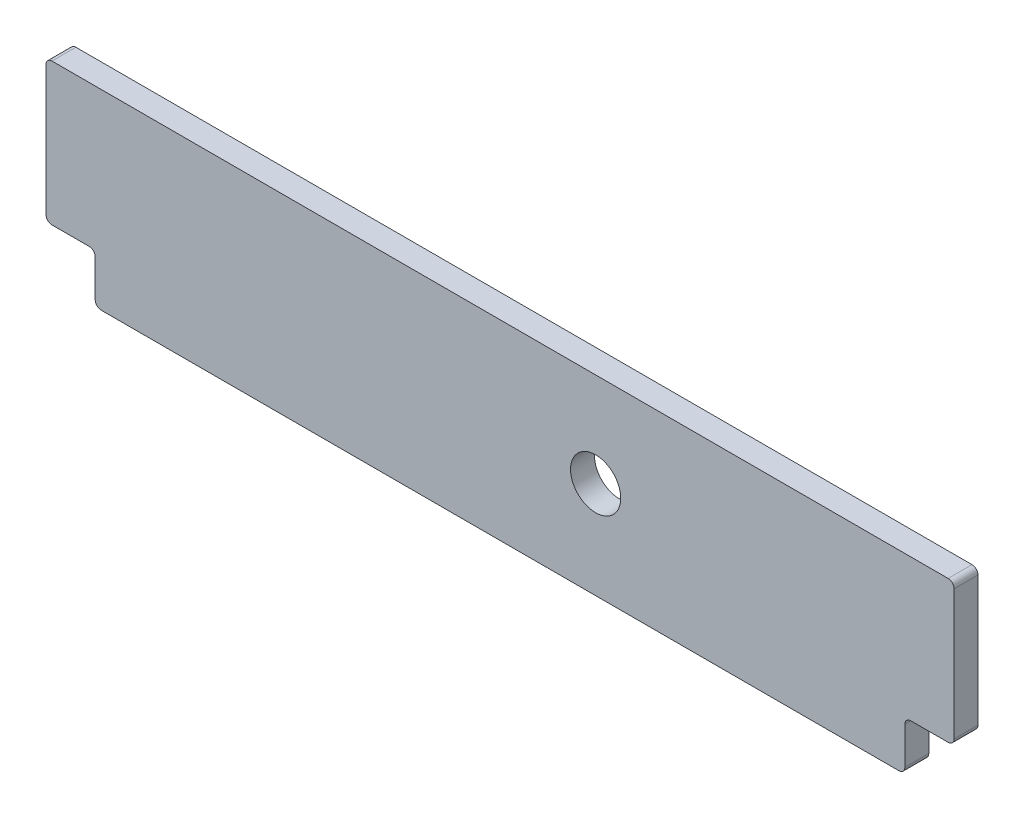
ISO-10303-21;
HEADER;
FILE_DESCRIPTION(('STEP AP214'),'2;1');
FILE_NAME('part.step','',(''),(''),'','','');
FILE_SCHEMA(('AUTOMOTIVE_DESIGN { 1 0 10303 214 1 1 1 1 }'));
ENDSEC;
DATA;
#1=APPLICATION_CONTEXT('core data for automotive mechanical design processes');
#2=APPLICATION_PROTOCOL_DEFINITION('international standard','automotive_design',2000,#1);
#3=PRODUCT_CONTEXT('',#1,'mechanical');
#4=PRODUCT('Part','Part','',(#3));
#5=PRODUCT_RELATED_PRODUCT_CATEGORY('part','',(#4));
#6=PRODUCT_DEFINITION_FORMATION('','',#4);
#7=PRODUCT_DEFINITION_CONTEXT('part definition',#1,'design');
#8=PRODUCT_DEFINITION('design','',#6,#7);
#9=PRODUCT_DEFINITION_SHAPE('','',#8);
#10=(LENGTH_UNIT() NAMED_UNIT(*) SI_UNIT(.MILLI.,.METRE.));
#11=(NAMED_UNIT(*) PLANE_ANGLE_UNIT() SI_UNIT($,.RADIAN.));
#12=(NAMED_UNIT(*) SI_UNIT($,.STERADIAN.) SOLID_ANGLE_UNIT());
#13=UNCERTAINTY_MEASURE_WITH_UNIT(LENGTH_MEASURE(1.E-05),#10,'distance_accuracy_value','');
#14=(GEOMETRIC_REPRESENTATION_CONTEXT(3) GLOBAL_UNCERTAINTY_ASSIGNED_CONTEXT((#13)) GLOBAL_UNIT_ASSIGNED_CONTEXT((#10,
#11,#12)) REPRESENTATION_CONTEXT('',''));
#15=CARTESIAN_POINT('',(0.,0.,0.));
#16=DIRECTION('',(0.,0.,1.));
#17=DIRECTION('',(1.,0.,0.));
#18=AXIS2_PLACEMENT_3D('',#15,#16,#17);
#19=CARTESIAN_POINT('',(215.138,0.,6.35));
#20=DIRECTION('',(-1.,0.,0.));
#21=DIRECTION('',(0.,-1.,0.));
#22=AXIS2_PLACEMENT_3D('',#19,#20,#21);
#23=PLANE('',#22);
#24=DIRECTION('',(0.,1.,0.));
#25=VECTOR('',#24,1.);
#26=CARTESIAN_POINT('',(215.138,2.35089725464378E-13,6.35));
#27=LINE('',#26,#25);
#28=CARTESIAN_POINT('',(215.138,3.17500000000005,6.35));
#29=VERTEX_POINT('',#28);
#30=CARTESIAN_POINT('',(215.138,22.9869999999999,6.35));
#31=VERTEX_POINT('',#30);
#32=EDGE_CURVE('E236',#29,#31,#27,.T.);
#33=ORIENTED_EDGE('',*,*,#32,.F.);
#34=DIRECTION('',(0.,0.,-1.));
#35=VECTOR('',#34,1.);
#36=CARTESIAN_POINT('',(215.138,3.17500000000005,6.35));
#37=LINE('',#36,#35);
#38=CARTESIAN_POINT('',(215.138,3.17500000000005,-6.35));
#39=VERTEX_POINT('',#38);
#40=EDGE_CURVE('E293',#29,#39,#37,.T.);
#41=ORIENTED_EDGE('',*,*,#40,.T.);
#42=DIRECTION('',(0.,1.,0.));
#43=VECTOR('',#42,1.);
#44=CARTESIAN_POINT('',(215.138,2.35089725464378E-13,-6.35));
#45=LINE('',#44,#43);
#46=CARTESIAN_POINT('',(215.138,22.9869999999999,-6.35));
#47=VERTEX_POINT('',#46);
#48=EDGE_CURVE('E232',#39,#47,#45,.T.);
#49=ORIENTED_EDGE('',*,*,#48,.T.);
#50=DIRECTION('',(0.,0.,-1.));
#51=VECTOR('',#50,1.);
#52=CARTESIAN_POINT('',(215.138,22.9869999999999,6.35));
#53=LINE('',#52,#51);
#54=EDGE_CURVE('E290',#47,#31,#53,.F.);
#55=ORIENTED_EDGE('',*,*,#54,.T.);
#56=EDGE_LOOP('',(#33,#41,#49,#55));
#57=FACE_BOUND('',#56,.T.);
#58=ADVANCED_FACE('F44',(#57),#23,.F.);
#59=CARTESIAN_POINT('',(215.9,26.1619999999999,6.35));
#60=DIRECTION('',(0.,1.,0.));
#61=DIRECTION('',(-1.,0.,0.));
#62=AXIS2_PLACEMENT_3D('',#59,#60,#61);
#63=PLANE('',#62);
#64=DIRECTION('',(1.,0.,0.));
#65=VECTOR('',#64,1.);
#66=CARTESIAN_POINT('',(0.,26.162,6.35));
#67=LINE('',#66,#65);
#68=CARTESIAN_POINT('',(218.313,26.1619999999999,6.35));
#69=VERTEX_POINT('',#68);
#70=CARTESIAN_POINT('',(238.125,26.1619999999999,6.35));
#71=VERTEX_POINT('',#70);
#72=EDGE_CURVE('E218',#69,#71,#67,.T.);
#73=ORIENTED_EDGE('',*,*,#72,.F.);
#74=DIRECTION('',(0.,0.,-1.));
#75=VECTOR('',#74,1.);
#76=CARTESIAN_POINT('',(218.313,26.1619999999999,-6.35));
#77=LINE('',#76,#75);
#78=CARTESIAN_POINT('',(218.313,26.1619999999999,-6.35));
#79=VERTEX_POINT('',#78);
#80=EDGE_CURVE('E306',#69,#79,#77,.T.);
#81=ORIENTED_EDGE('',*,*,#80,.T.);
#82=DIRECTION('',(1.,0.,0.));
#83=VECTOR('',#82,1.);
#84=CARTESIAN_POINT('',(0.,26.162,-6.35));
#85=LINE('',#84,#83);
#86=CARTESIAN_POINT('',(238.125,26.1619999999999,-6.35));
#87=VERTEX_POINT('',#86);
#88=EDGE_CURVE('E198',#79,#87,#85,.T.);
#89=ORIENTED_EDGE('',*,*,#88,.T.);
#90=DIRECTION('',(0.,0.,-1.));
#91=VECTOR('',#90,1.);
#92=CARTESIAN_POINT('',(238.125,26.1619999999999,6.35));
#93=LINE('',#92,#91);
#94=EDGE_CURVE('E303',#87,#71,#93,.F.);
#95=ORIENTED_EDGE('',*,*,#94,.T.);
#96=EDGE_LOOP('',(#73,#81,#89,#95));
#97=FACE_BOUND('',#96,.T.);
#98=ADVANCED_FACE('F355',(#97),#63,.F.);
#99=CARTESIAN_POINT('',(241.3,101.6,6.35));
#100=DIRECTION('',(-1.,0.,0.));
#101=DIRECTION('',(0.,-1.,0.));
#102=AXIS2_PLACEMENT_3D('',#99,#100,#101);
#103=PLANE('',#102);
#104=DIRECTION('',(0.,1.,0.));
#105=VECTOR('',#104,1.);
#106=CARTESIAN_POINT('',(241.3,101.6,-6.35));
#107=LINE('',#106,#105);
#108=CARTESIAN_POINT('',(241.3,29.3369999999999,-6.35));
#109=VERTEX_POINT('',#108);
#110=CARTESIAN_POINT('',(241.3,98.4249999999999,-6.35));
#111=VERTEX_POINT('',#110);
#112=EDGE_CURVE('E191',#109,#111,#107,.T.);
#113=ORIENTED_EDGE('',*,*,#112,.T.);
#114=DIRECTION('',(0.,0.,-1.));
#115=VECTOR('',#114,1.);
#116=CARTESIAN_POINT('',(241.3,98.4249999999999,6.35));
#117=LINE('',#116,#115);
#118=CARTESIAN_POINT('',(241.3,98.4249999999999,6.35));
#119=VERTEX_POINT('',#118);
#120=EDGE_CURVE('E166',#111,#119,#117,.F.);
#121=ORIENTED_EDGE('',*,*,#120,.T.);
#122=DIRECTION('',(0.,1.,0.));
#123=VECTOR('',#122,1.);
#124=CARTESIAN_POINT('',(241.3,101.6,6.35));
#125=LINE('',#124,#123);
#126=CARTESIAN_POINT('',(241.3,29.3369999999999,6.35));
#127=VERTEX_POINT('',#126);
#128=EDGE_CURVE('E214',#127,#119,#125,.T.);
#129=ORIENTED_EDGE('',*,*,#128,.F.);
#130=DIRECTION('',(0.,0.,-1.));
#131=VECTOR('',#130,1.);
#132=CARTESIAN_POINT('',(241.3,29.3369999999999,6.35));
#133=LINE('',#132,#131);
#134=EDGE_CURVE('E172',#127,#109,#133,.T.);
#135=ORIENTED_EDGE('',*,*,#134,.T.);
#136=EDGE_LOOP('',(#113,#121,#129,#135));
#137=FACE_BOUND('',#136,.T.);
#138=ADVANCED_FACE('F348',(#137),#103,.F.);
#139=CARTESIAN_POINT('',(-241.3,101.6,6.35));
#140=DIRECTION('',(0.,-1.,0.));
#141=DIRECTION('',(1.,0.,0.));
#142=AXIS2_PLACEMENT_3D('',#139,#140,#141);
#143=PLANE('',#142);
#144=DIRECTION('',(-1.,0.,0.));
#145=VECTOR('',#144,1.);
#146=CARTESIAN_POINT('',(-241.3,101.6,6.35));
#147=LINE('',#146,#145);
#148=CARTESIAN_POINT('',(238.125,101.6,6.35));
#149=VERTEX_POINT('',#148);
#150=CARTESIAN_POINT('',(-238.125,101.6,6.35));
#151=VERTEX_POINT('',#150);
#152=EDGE_CURVE('E182',#149,#151,#147,.T.);
#153=ORIENTED_EDGE('',*,*,#152,.F.);
#154=DIRECTION('',(0.,0.,-1.));
#155=VECTOR('',#154,1.);
#156=CARTESIAN_POINT('',(238.125,101.6,6.35));
#157=LINE('',#156,#155);
#158=CARTESIAN_POINT('',(238.125,101.6,-6.35));
#159=VERTEX_POINT('',#158);
#160=EDGE_CURVE('E165',#149,#159,#157,.T.);
#161=ORIENTED_EDGE('',*,*,#160,.T.);
#162=DIRECTION('',(-1.,0.,0.));
#163=VECTOR('',#162,1.);
#164=CARTESIAN_POINT('',(-241.3,101.6,-6.35));
#165=LINE('',#164,#163);
#166=CARTESIAN_POINT('',(-238.125,101.6,-6.35));
#167=VERTEX_POINT('',#166);
#168=EDGE_CURVE('E179',#159,#167,#165,.T.);
#169=ORIENTED_EDGE('',*,*,#168,.T.);
#170=DIRECTION('',(0.,0.,-1.));
#171=VECTOR('',#170,1.);
#172=CARTESIAN_POINT('',(-238.125,101.6,6.35));
#173=LINE('',#172,#171);
#174=EDGE_CURVE('E185',#167,#151,#173,.F.);
#175=ORIENTED_EDGE('',*,*,#174,.T.);
#176=EDGE_LOOP('',(#153,#161,#169,#175));
#177=FACE_BOUND('',#176,.T.);
#178=ADVANCED_FACE('F178',(#177),#143,.F.);
#179=CARTESIAN_POINT('',(-241.3,101.6,6.35));
#180=DIRECTION('',(1.,0.,0.));
#181=DIRECTION('',(0.,0.,-1.));
#182=AXIS2_PLACEMENT_3D('',#179,#180,#181);
#183=PLANE('',#182);
#184=DIRECTION('',(0.,-1.,0.));
#185=VECTOR('',#184,1.);
#186=CARTESIAN_POINT('',(-241.3,101.6,6.35));
#187=LINE('',#186,#185);
#188=CARTESIAN_POINT('',(-241.3,98.4250000000001,6.35));
#189=VERTEX_POINT('',#188);
#190=CARTESIAN_POINT('',(-241.3,29.3370000000001,6.35));
#191=VERTEX_POINT('',#190);
#192=EDGE_CURVE('E207',#189,#191,#187,.T.);
#193=ORIENTED_EDGE('',*,*,#192,.F.);
#194=DIRECTION('',(0.,0.,-1.));
#195=VECTOR('',#194,1.);
#196=CARTESIAN_POINT('',(-241.3,98.4250000000001,6.35));
#197=LINE('',#196,#195);
#198=CARTESIAN_POINT('',(-241.3,98.4250000000001,-6.35));
#199=VERTEX_POINT('',#198);
#200=EDGE_CURVE('E286',#189,#199,#197,.T.);
#201=ORIENTED_EDGE('',*,*,#200,.T.);
#202=DIRECTION('',(0.,-1.,0.));
#203=VECTOR('',#202,1.);
#204=CARTESIAN_POINT('',(-241.3,101.6,-6.35));
#205=LINE('',#204,#203);
#206=CARTESIAN_POINT('',(-241.3,29.3370000000001,-6.35));
#207=VERTEX_POINT('',#206);
#208=EDGE_CURVE('E190',#199,#207,#205,.T.);
#209=ORIENTED_EDGE('',*,*,#208,.T.);
#210=DIRECTION('',(0.,0.,-1.));
#211=VECTOR('',#210,1.);
#212=CARTESIAN_POINT('',(-241.3,29.337,6.35));
#213=LINE('',#212,#211);
#214=EDGE_CURVE('E283',#207,#191,#213,.F.);
#215=ORIENTED_EDGE('',*,*,#214,.T.);
#216=EDGE_LOOP('',(#193,#201,#209,#215));
#217=FACE_BOUND('',#216,.T.);
#218=ADVANCED_FACE('F394',(#217),#183,.F.);
#219=CARTESIAN_POINT('',(-215.9,26.162,6.35));
#220=DIRECTION('',(0.,1.,0.));
#221=DIRECTION('',(0.,0.,1.));
#222=AXIS2_PLACEMENT_3D('',#219,#220,#221);
#223=PLANE('',#222);
#224=DIRECTION('',(1.,0.,0.));
#225=VECTOR('',#224,1.);
#226=CARTESIAN_POINT('',(0.,26.162,6.35));
#227=LINE('',#226,#225);
#228=CARTESIAN_POINT('',(-238.125,26.162,6.35));
#229=VERTEX_POINT('',#228);
#230=CARTESIAN_POINT('',(-218.313,26.162,6.35));
#231=VERTEX_POINT('',#230);
#232=EDGE_CURVE('E211',#229,#231,#227,.T.);
#233=ORIENTED_EDGE('',*,*,#232,.F.);
#234=DIRECTION('',(0.,0.,-1.));
#235=VECTOR('',#234,1.);
#236=CARTESIAN_POINT('',(-238.125,26.162,6.35));
#237=LINE('',#236,#235);
#238=CARTESIAN_POINT('',(-238.125,26.162,-6.35));
#239=VERTEX_POINT('',#238);
#240=EDGE_CURVE('E313',#229,#239,#237,.T.);
#241=ORIENTED_EDGE('',*,*,#240,.T.);
#242=DIRECTION('',(1.,0.,0.));
#243=VECTOR('',#242,1.);
#244=CARTESIAN_POINT('',(0.,26.162,-6.35));
#245=LINE('',#244,#243);
#246=CARTESIAN_POINT('',(-218.313,26.162,-6.35));
#247=VERTEX_POINT('',#246);
#248=EDGE_CURVE('E196',#239,#247,#245,.T.);
#249=ORIENTED_EDGE('',*,*,#248,.T.);
#250=DIRECTION('',(0.,0.,-1.));
#251=VECTOR('',#250,1.);
#252=CARTESIAN_POINT('',(-218.313,26.162,6.35));
#253=LINE('',#252,#251);
#254=EDGE_CURVE('E310',#247,#231,#253,.F.);
#255=ORIENTED_EDGE('',*,*,#254,.T.);
#256=EDGE_LOOP('',(#233,#241,#249,#255));
#257=FACE_BOUND('',#256,.T.);
#258=ADVANCED_FACE('F386',(#257),#223,.F.);
#259=CARTESIAN_POINT('',(-215.138,25.4,6.35));
#260=DIRECTION('',(1.,0.,0.));
#261=DIRECTION('',(0.,0.,-1.));
#262=AXIS2_PLACEMENT_3D('',#259,#260,#261);
#263=PLANE('',#262);
#264=DIRECTION('',(0.,-1.,0.));
#265=VECTOR('',#264,1.);
#266=CARTESIAN_POINT('',(-215.138,0.,-6.35));
#267=LINE('',#266,#265);
#268=CARTESIAN_POINT('',(-215.138,22.987,-6.35));
#269=VERTEX_POINT('',#268);
#270=CARTESIAN_POINT('',(-215.138,3.17500000000004,-6.35));
#271=VERTEX_POINT('',#270);
#272=EDGE_CURVE('E222',#269,#271,#267,.T.);
#273=ORIENTED_EDGE('',*,*,#272,.T.);
#274=DIRECTION('',(0.,0.,-1.));
#275=VECTOR('',#274,1.);
#276=CARTESIAN_POINT('',(-215.138,3.17500000000004,6.35));
#277=LINE('',#276,#275);
#278=CARTESIAN_POINT('',(-215.138,3.17500000000004,6.35));
#279=VERTEX_POINT('',#278);
#280=EDGE_CURVE('E321',#271,#279,#277,.F.);
#281=ORIENTED_EDGE('',*,*,#280,.T.);
#282=DIRECTION('',(0.,-1.,0.));
#283=VECTOR('',#282,1.);
#284=CARTESIAN_POINT('',(-215.138,0.,6.35));
#285=LINE('',#284,#283);
#286=CARTESIAN_POINT('',(-215.138,22.987,6.35));
#287=VERTEX_POINT('',#286);
#288=EDGE_CURVE('E206',#287,#279,#285,.T.);
#289=ORIENTED_EDGE('',*,*,#288,.F.);
#290=DIRECTION('',(0.,0.,-1.));
#291=VECTOR('',#290,1.);
#292=CARTESIAN_POINT('',(-215.138,22.987,-6.35));
#293=LINE('',#292,#291);
#294=EDGE_CURVE('E317',#287,#269,#293,.T.);
#295=ORIENTED_EDGE('',*,*,#294,.T.);
#296=EDGE_LOOP('',(#273,#281,#289,#295));
#297=FACE_BOUND('',#296,.T.);
#298=ADVANCED_FACE('F376',(#297),#263,.F.);
#299=CARTESIAN_POINT('',(-215.9,0.,6.35));
#300=DIRECTION('',(0.,1.,0.));
#301=DIRECTION('',(0.,0.,1.));
#302=AXIS2_PLACEMENT_3D('',#299,#300,#301);
#303=PLANE('',#302);
#304=DIRECTION('',(1.,0.,0.));
#305=VECTOR('',#304,1.);
#306=CARTESIAN_POINT('',(-215.9,0.,-6.35));
#307=LINE('',#306,#305);
#308=CARTESIAN_POINT('',(-211.963,0.,-6.35));
#309=VERTEX_POINT('',#308);
#310=CARTESIAN_POINT('',(211.963,0.,-6.35));
#311=VERTEX_POINT('',#310);
#312=EDGE_CURVE('E231',#309,#311,#307,.T.);
#313=ORIENTED_EDGE('',*,*,#312,.T.);
#314=DIRECTION('',(0.,0.,-1.));
#315=VECTOR('',#314,1.);
#316=CARTESIAN_POINT('',(211.963,0.,6.35));
#317=LINE('',#316,#315);
#318=CARTESIAN_POINT('',(211.963,0.,6.35));
#319=VERTEX_POINT('',#318);
#320=EDGE_CURVE('E62',#311,#319,#317,.F.);
#321=ORIENTED_EDGE('',*,*,#320,.T.);
#322=DIRECTION('',(1.,0.,0.));
#323=VECTOR('',#322,1.);
#324=CARTESIAN_POINT('',(-215.9,0.,6.35));
#325=LINE('',#324,#323);
#326=CARTESIAN_POINT('',(-211.963,0.,6.35));
#327=VERTEX_POINT('',#326);
#328=EDGE_CURVE('E202',#327,#319,#325,.T.);
#329=ORIENTED_EDGE('',*,*,#328,.F.);
#330=DIRECTION('',(0.,0.,-1.));
#331=VECTOR('',#330,1.);
#332=CARTESIAN_POINT('',(-211.963,0.,6.35));
#333=LINE('',#332,#331);
#334=EDGE_CURVE('E297',#327,#309,#333,.T.);
#335=ORIENTED_EDGE('',*,*,#334,.T.);
#336=EDGE_LOOP('',(#313,#321,#329,#335));
#337=FACE_BOUND('',#336,.T.);
#338=ADVANCED_FACE('F342',(#337),#303,.F.);
#339=CARTESIAN_POINT('',(0.,0.,6.35));
#340=DIRECTION('',(0.,0.,-1.));
#341=DIRECTION('',(-1.,0.,0.));
#342=AXIS2_PLACEMENT_3D('',#339,#340,#341);
#343=PLANE('',#342);
#344=CARTESIAN_POINT('',(50.8000000000006,51.5000000000016,6.34999999999999));
#345=DIRECTION('',(0.,0.,-1.));
#346=DIRECTION('',(-1.,0.,0.));
#347=AXIS2_PLACEMENT_3D('',#344,#345,#346);
#348=CIRCLE('',#347,13.3350000000001);
#349=CARTESIAN_POINT('',(37.4650000000005,51.5000000000016,6.34999999999999));
#350=VERTEX_POINT('',#349);
#351=EDGE_CURVE('E48',#350,#350,#348,.F.);
#352=ORIENTED_EDGE('',*,*,#351,.F.);
#353=EDGE_LOOP('',(#352));
#354=FACE_BOUND('',#353,.T.);
#355=ORIENTED_EDGE('',*,*,#128,.T.);
#356=CARTESIAN_POINT('',(238.125,98.4249999999999,6.35));
#357=DIRECTION('',(0.,0.,-1.));
#358=DIRECTION('',(-1.,0.,0.));
#359=AXIS2_PLACEMENT_3D('',#356,#357,#358);
#360=CIRCLE('',#359,3.175);
#361=EDGE_CURVE('E280',#119,#149,#360,.F.);
#362=ORIENTED_EDGE('',*,*,#361,.T.);
#363=ORIENTED_EDGE('',*,*,#152,.T.);
#364=CARTESIAN_POINT('',(-238.125,98.4250000000001,6.35));
#365=DIRECTION('',(0.,0.,-1.));
#366=DIRECTION('',(-1.,0.,0.));
#367=AXIS2_PLACEMENT_3D('',#364,#365,#366);
#368=CIRCLE('',#367,3.175);
#369=EDGE_CURVE('E277',#151,#189,#368,.F.);
#370=ORIENTED_EDGE('',*,*,#369,.T.);
#371=ORIENTED_EDGE('',*,*,#192,.T.);
#372=CARTESIAN_POINT('',(-238.125,29.337,6.35));
#373=DIRECTION('',(0.,0.,-1.));
#374=DIRECTION('',(-1.,0.,0.));
#375=AXIS2_PLACEMENT_3D('',#372,#373,#374);
#376=CIRCLE('',#375,3.175);
#377=EDGE_CURVE('E268',#191,#229,#376,.F.);
#378=ORIENTED_EDGE('',*,*,#377,.T.);
#379=ORIENTED_EDGE('',*,*,#232,.T.);
#380=CARTESIAN_POINT('',(-218.313,22.987,6.35));
#381=DIRECTION('',(0.,0.,-1.));
#382=DIRECTION('',(-1.,0.,0.));
#383=AXIS2_PLACEMENT_3D('',#380,#381,#382);
#384=CIRCLE('',#383,3.175);
#385=EDGE_CURVE('E12',#231,#287,#384,.T.);
#386=ORIENTED_EDGE('',*,*,#385,.T.);
#387=ORIENTED_EDGE('',*,*,#288,.T.);
#388=CARTESIAN_POINT('',(-211.963,3.17500000000004,6.35));
#389=DIRECTION('',(0.,0.,-1.));
#390=DIRECTION('',(-1.,0.,0.));
#391=AXIS2_PLACEMENT_3D('',#388,#389,#390);
#392=CIRCLE('',#391,3.175);
#393=EDGE_CURVE('E69',#279,#327,#392,.F.);
#394=ORIENTED_EDGE('',*,*,#393,.T.);
#395=ORIENTED_EDGE('',*,*,#328,.T.);
#396=CARTESIAN_POINT('',(211.963,3.17500000000004,6.35));
#397=DIRECTION('',(0.,0.,-1.));
#398=DIRECTION('',(-1.,0.,0.));
#399=AXIS2_PLACEMENT_3D('',#396,#397,#398);
#400=CIRCLE('',#399,3.175);
#401=EDGE_CURVE('E274',#319,#29,#400,.F.);
#402=ORIENTED_EDGE('',*,*,#401,.T.);
#403=ORIENTED_EDGE('',*,*,#32,.T.);
#404=CARTESIAN_POINT('',(218.313,22.9869999999999,6.35));
#405=DIRECTION('',(0.,0.,-1.));
#406=DIRECTION('',(-1.,0.,0.));
#407=AXIS2_PLACEMENT_3D('',#404,#405,#406);
#408=CIRCLE('',#407,3.175);
#409=EDGE_CURVE('E327',#31,#69,#408,.T.);
#410=ORIENTED_EDGE('',*,*,#409,.T.);
#411=ORIENTED_EDGE('',*,*,#72,.T.);
#412=CARTESIAN_POINT('',(238.125,29.3369999999999,6.35));
#413=DIRECTION('',(0.,0.,-1.));
#414=DIRECTION('',(-1.,0.,0.));
#415=AXIS2_PLACEMENT_3D('',#412,#413,#414);
#416=CIRCLE('',#415,3.175);
#417=EDGE_CURVE('E271',#71,#127,#416,.F.);
#418=ORIENTED_EDGE('',*,*,#417,.T.);
#419=EDGE_LOOP('',(#355,#362,#363,#370,#371,#378,#379,#386,#387,#394,#395,#402,#403,#410,#411,#418));
#420=FACE_BOUND('',#419,.T.);
#421=ADVANCED_FACE('F340',(#354,#420),#343,.F.);
#422=CARTESIAN_POINT('',(0.,0.,-6.35));
#423=DIRECTION('',(0.,0.,-1.));
#424=DIRECTION('',(-1.,0.,0.));
#425=AXIS2_PLACEMENT_3D('',#422,#423,#424);
#426=PLANE('',#425);
#427=CARTESIAN_POINT('',(50.8000000000006,51.5000000000016,-6.34999999999999));
#428=DIRECTION('',(0.,0.,-1.));
#429=DIRECTION('',(-1.,0.,0.));
#430=AXIS2_PLACEMENT_3D('',#427,#428,#429);
#431=CIRCLE('',#430,13.3350000000001);
#432=CARTESIAN_POINT('',(37.4650000000005,51.5000000000016,-6.34999999999999));
#433=VERTEX_POINT('',#432);
#434=EDGE_CURVE('E205',#433,#433,#431,.F.);
#435=ORIENTED_EDGE('',*,*,#434,.T.);
#436=EDGE_LOOP('',(#435));
#437=FACE_BOUND('',#436,.T.);
#438=ORIENTED_EDGE('',*,*,#168,.F.);
#439=CARTESIAN_POINT('',(238.125,98.4249999999999,-6.35));
#440=DIRECTION('',(0.,0.,-1.));
#441=DIRECTION('',(-1.,0.,0.));
#442=AXIS2_PLACEMENT_3D('',#439,#440,#441);
#443=CIRCLE('',#442,3.175);
#444=EDGE_CURVE('E161',#159,#111,#443,.T.);
#445=ORIENTED_EDGE('',*,*,#444,.T.);
#446=ORIENTED_EDGE('',*,*,#112,.F.);
#447=CARTESIAN_POINT('',(238.125,29.3369999999999,-6.35));
#448=DIRECTION('',(0.,0.,-1.));
#449=DIRECTION('',(-1.,0.,0.));
#450=AXIS2_PLACEMENT_3D('',#447,#448,#449);
#451=CIRCLE('',#450,3.175);
#452=EDGE_CURVE('E253',#109,#87,#451,.T.);
#453=ORIENTED_EDGE('',*,*,#452,.T.);
#454=ORIENTED_EDGE('',*,*,#88,.F.);
#455=CARTESIAN_POINT('',(218.313,22.9869999999999,-6.35));
#456=DIRECTION('',(0.,0.,-1.));
#457=DIRECTION('',(-1.,0.,0.));
#458=AXIS2_PLACEMENT_3D('',#455,#456,#457);
#459=CIRCLE('',#458,3.175);
#460=EDGE_CURVE('E324',#79,#47,#459,.F.);
#461=ORIENTED_EDGE('',*,*,#460,.T.);
#462=ORIENTED_EDGE('',*,*,#48,.F.);
#463=CARTESIAN_POINT('',(211.963,3.17500000000004,-6.35));
#464=DIRECTION('',(0.,0.,-1.));
#465=DIRECTION('',(-1.,0.,0.));
#466=AXIS2_PLACEMENT_3D('',#463,#464,#465);
#467=CIRCLE('',#466,3.175);
#468=EDGE_CURVE('E256',#39,#311,#467,.T.);
#469=ORIENTED_EDGE('',*,*,#468,.T.);
#470=ORIENTED_EDGE('',*,*,#312,.F.);
#471=CARTESIAN_POINT('',(-211.963,3.17500000000004,-6.35));
#472=DIRECTION('',(0.,0.,-1.));
#473=DIRECTION('',(-1.,0.,0.));
#474=AXIS2_PLACEMENT_3D('',#471,#472,#473);
#475=CIRCLE('',#474,3.175);
#476=EDGE_CURVE('E184',#309,#271,#475,.T.);
#477=ORIENTED_EDGE('',*,*,#476,.T.);
#478=ORIENTED_EDGE('',*,*,#272,.F.);
#479=CARTESIAN_POINT('',(-218.313,22.987,-6.35));
#480=DIRECTION('',(0.,0.,-1.));
#481=DIRECTION('',(-1.,0.,0.));
#482=AXIS2_PLACEMENT_3D('',#479,#480,#481);
#483=CIRCLE('',#482,3.175);
#484=EDGE_CURVE('E54',#269,#247,#483,.F.);
#485=ORIENTED_EDGE('',*,*,#484,.T.);
#486=ORIENTED_EDGE('',*,*,#248,.F.);
#487=CARTESIAN_POINT('',(-238.125,29.337,-6.35));
#488=DIRECTION('',(0.,0.,-1.));
#489=DIRECTION('',(-1.,0.,0.));
#490=AXIS2_PLACEMENT_3D('',#487,#488,#489);
#491=CIRCLE('',#490,3.175);
#492=EDGE_CURVE('E250',#239,#207,#491,.T.);
#493=ORIENTED_EDGE('',*,*,#492,.T.);
#494=ORIENTED_EDGE('',*,*,#208,.F.);
#495=CARTESIAN_POINT('',(-238.125,98.4250000000001,-6.35));
#496=DIRECTION('',(0.,0.,-1.));
#497=DIRECTION('',(-1.,0.,0.));
#498=AXIS2_PLACEMENT_3D('',#495,#496,#497);
#499=CIRCLE('',#498,3.175);
#500=EDGE_CURVE('E173',#199,#167,#499,.T.);
#501=ORIENTED_EDGE('',*,*,#500,.T.);
#502=EDGE_LOOP('',(#438,#445,#446,#453,#454,#461,#462,#469,#470,#477,#478,#485,#486,#493,#494,#501));
#503=FACE_BOUND('',#502,.T.);
#504=ADVANCED_FACE('F187',(#437,#503),#426,.T.);
#505=CARTESIAN_POINT('',(50.8000000000006,51.5000000000017,-101.056542434233));
#506=DIRECTION('',(0.,0.,1.));
#507=DIRECTION('',(0.,-1.,0.));
#508=AXIS2_PLACEMENT_3D('',#505,#506,#507);
#509=CYLINDRICAL_SURFACE('',#508,13.3350000000001);
#510=ORIENTED_EDGE('',*,*,#434,.F.);
#511=EDGE_LOOP('',(#510));
#512=FACE_BOUND('',#511,.T.);
#513=ORIENTED_EDGE('',*,*,#351,.T.);
#514=EDGE_LOOP('',(#513));
#515=FACE_BOUND('',#514,.T.);
#516=ADVANCED_FACE('F46',(#512,#515),#509,.F.);
#517=CARTESIAN_POINT('',(238.125,98.4249999999999,6.35));
#518=DIRECTION('',(0.,0.,-1.));
#519=DIRECTION('',(-1.,0.,0.));
#520=AXIS2_PLACEMENT_3D('',#517,#518,#519);
#521=CYLINDRICAL_SURFACE('',#520,3.175);
#522=ORIENTED_EDGE('',*,*,#361,.F.);
#523=ORIENTED_EDGE('',*,*,#120,.F.);
#524=ORIENTED_EDGE('',*,*,#444,.F.);
#525=ORIENTED_EDGE('',*,*,#160,.F.);
#526=EDGE_LOOP('',(#522,#523,#524,#525));
#527=FACE_BOUND('',#526,.T.);
#528=ADVANCED_FACE('F164',(#527),#521,.T.);
#529=CARTESIAN_POINT('',(-238.125,98.4250000000001,6.35));
#530=DIRECTION('',(0.,0.,-1.));
#531=DIRECTION('',(-1.,0.,0.));
#532=AXIS2_PLACEMENT_3D('',#529,#530,#531);
#533=CYLINDRICAL_SURFACE('',#532,3.175);
#534=ORIENTED_EDGE('',*,*,#369,.F.);
#535=ORIENTED_EDGE('',*,*,#174,.F.);
#536=ORIENTED_EDGE('',*,*,#500,.F.);
#537=ORIENTED_EDGE('',*,*,#200,.F.);
#538=EDGE_LOOP('',(#534,#535,#536,#537));
#539=FACE_BOUND('',#538,.T.);
#540=ADVANCED_FACE('F398',(#539),#533,.T.);
#541=CARTESIAN_POINT('',(211.963,3.17500000000004,6.35));
#542=DIRECTION('',(0.,0.,-1.));
#543=DIRECTION('',(-1.,0.,0.));
#544=AXIS2_PLACEMENT_3D('',#541,#542,#543);
#545=CYLINDRICAL_SURFACE('',#544,3.175);
#546=ORIENTED_EDGE('',*,*,#401,.F.);
#547=ORIENTED_EDGE('',*,*,#320,.F.);
#548=ORIENTED_EDGE('',*,*,#468,.F.);
#549=ORIENTED_EDGE('',*,*,#40,.F.);
#550=EDGE_LOOP('',(#546,#547,#548,#549));
#551=FACE_BOUND('',#550,.T.);
#552=ADVANCED_FACE('F367',(#551),#545,.T.);
#553=CARTESIAN_POINT('',(218.313,22.9869999999999,6.35));
#554=DIRECTION('',(0.,0.,1.));
#555=DIRECTION('',(1.,0.,0.));
#556=AXIS2_PLACEMENT_3D('',#553,#554,#555);
#557=CYLINDRICAL_SURFACE('',#556,3.175);
#558=ORIENTED_EDGE('',*,*,#409,.F.);
#559=ORIENTED_EDGE('',*,*,#54,.F.);
#560=ORIENTED_EDGE('',*,*,#460,.F.);
#561=ORIENTED_EDGE('',*,*,#80,.F.);
#562=EDGE_LOOP('',(#558,#559,#560,#561));
#563=FACE_BOUND('',#562,.T.);
#564=ADVANCED_FACE('F359',(#563),#557,.F.);
#565=CARTESIAN_POINT('',(238.125,29.3369999999999,6.35));
#566=DIRECTION('',(0.,0.,-1.));
#567=DIRECTION('',(-1.,0.,0.));
#568=AXIS2_PLACEMENT_3D('',#565,#566,#567);
#569=CYLINDRICAL_SURFACE('',#568,3.175);
#570=ORIENTED_EDGE('',*,*,#417,.F.);
#571=ORIENTED_EDGE('',*,*,#94,.F.);
#572=ORIENTED_EDGE('',*,*,#452,.F.);
#573=ORIENTED_EDGE('',*,*,#134,.F.);
#574=EDGE_LOOP('',(#570,#571,#572,#573));
#575=FACE_BOUND('',#574,.T.);
#576=ADVANCED_FACE('F350',(#575),#569,.T.);
#577=CARTESIAN_POINT('',(-238.125,29.337,6.35));
#578=DIRECTION('',(0.,0.,-1.));
#579=DIRECTION('',(-1.,0.,0.));
#580=AXIS2_PLACEMENT_3D('',#577,#578,#579);
#581=CYLINDRICAL_SURFACE('',#580,3.175);
#582=ORIENTED_EDGE('',*,*,#377,.F.);
#583=ORIENTED_EDGE('',*,*,#214,.F.);
#584=ORIENTED_EDGE('',*,*,#492,.F.);
#585=ORIENTED_EDGE('',*,*,#240,.F.);
#586=EDGE_LOOP('',(#582,#583,#584,#585));
#587=FACE_BOUND('',#586,.T.);
#588=ADVANCED_FACE('F390',(#587),#581,.T.);
#589=CARTESIAN_POINT('',(-211.963,3.17500000000004,6.35));
#590=DIRECTION('',(0.,0.,-1.));
#591=DIRECTION('',(-1.,0.,0.));
#592=AXIS2_PLACEMENT_3D('',#589,#590,#591);
#593=CYLINDRICAL_SURFACE('',#592,3.175);
#594=ORIENTED_EDGE('',*,*,#393,.F.);
#595=ORIENTED_EDGE('',*,*,#280,.F.);
#596=ORIENTED_EDGE('',*,*,#476,.F.);
#597=ORIENTED_EDGE('',*,*,#334,.F.);
#598=EDGE_LOOP('',(#594,#595,#596,#597));
#599=FACE_BOUND('',#598,.T.);
#600=ADVANCED_FACE('F372',(#599),#593,.T.);
#601=CARTESIAN_POINT('',(-218.313,22.987,6.35));
#602=DIRECTION('',(0.,0.,1.));
#603=DIRECTION('',(1.,0.,0.));
#604=AXIS2_PLACEMENT_3D('',#601,#602,#603);
#605=CYLINDRICAL_SURFACE('',#604,3.175);
#606=ORIENTED_EDGE('',*,*,#385,.F.);
#607=ORIENTED_EDGE('',*,*,#254,.F.);
#608=ORIENTED_EDGE('',*,*,#484,.F.);
#609=ORIENTED_EDGE('',*,*,#294,.F.);
#610=EDGE_LOOP('',(#606,#607,#608,#609));
#611=FACE_BOUND('',#610,.T.);
#612=ADVANCED_FACE('F381',(#611),#605,.F.);
#613=CLOSED_SHELL('',(#58,#98,#138,#178,#218,#258,#298,#338,#421,#504,#516,#528,#540,#552,#564,
#576,#588,#600,#612));
#614=MANIFOLD_SOLID_BREP('B2',#613);
#615=ADVANCED_BREP_SHAPE_REPRESENTATION('',(#18,#614),#14);
#616=SHAPE_DEFINITION_REPRESENTATION(#9,#615);
ENDSEC;
END-ISO-10303-21;
